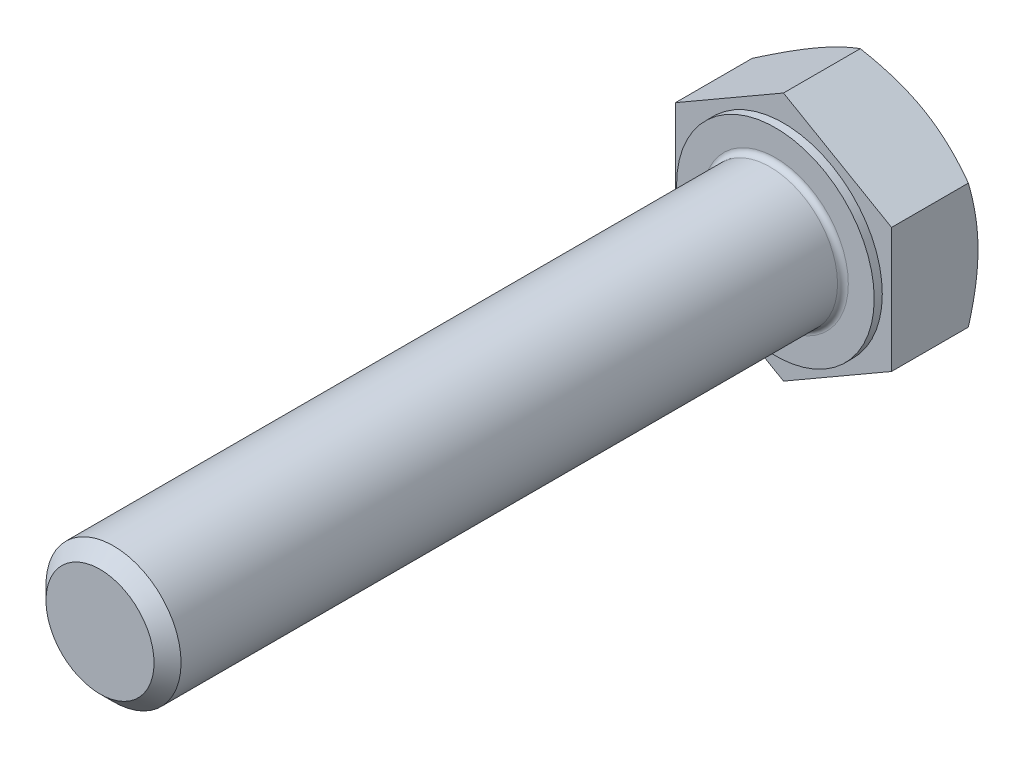
ISO-10303-21;
HEADER;
FILE_DESCRIPTION(('STEP AP214'),'2;1');
FILE_NAME('part.step','',(''),(''),'','','');
FILE_SCHEMA(('AUTOMOTIVE_DESIGN { 1 0 10303 214 1 1 1 1 }'));
ENDSEC;
DATA;
#1=APPLICATION_CONTEXT('core data for automotive mechanical design processes');
#2=APPLICATION_PROTOCOL_DEFINITION('international standard','automotive_design',2000,#1);
#3=PRODUCT_CONTEXT('',#1,'mechanical');
#4=PRODUCT('Part','Part','',(#3));
#5=PRODUCT_RELATED_PRODUCT_CATEGORY('part','',(#4));
#6=PRODUCT_DEFINITION_FORMATION('','',#4);
#7=PRODUCT_DEFINITION_CONTEXT('part definition',#1,'design');
#8=PRODUCT_DEFINITION('design','',#6,#7);
#9=PRODUCT_DEFINITION_SHAPE('','',#8);
#10=(LENGTH_UNIT() NAMED_UNIT(*) SI_UNIT(.MILLI.,.METRE.));
#11=(NAMED_UNIT(*) PLANE_ANGLE_UNIT() SI_UNIT($,.RADIAN.));
#12=(NAMED_UNIT(*) SI_UNIT($,.STERADIAN.) SOLID_ANGLE_UNIT());
#13=UNCERTAINTY_MEASURE_WITH_UNIT(LENGTH_MEASURE(1.E-05),#10,'distance_accuracy_value','');
#14=(GEOMETRIC_REPRESENTATION_CONTEXT(3) GLOBAL_UNCERTAINTY_ASSIGNED_CONTEXT((#13)) GLOBAL_UNIT_ASSIGNED_CONTEXT((#10,
#11,#12)) REPRESENTATION_CONTEXT('',''));
#15=CARTESIAN_POINT('',(0.,0.,0.));
#16=DIRECTION('',(0.,0.,1.));
#17=DIRECTION('',(1.,0.,0.));
#18=AXIS2_PLACEMENT_3D('',#15,#16,#17);
#19=CARTESIAN_POINT('',(0.,0.,7.));
#20=DIRECTION('',(0.,0.,1.));
#21=DIRECTION('',(1.,0.,0.));
#22=AXIS2_PLACEMENT_3D('',#19,#20,#21);
#23=PLANE('',#22);
#24=CARTESIAN_POINT('',(0.,0.,7.));
#25=DIRECTION('',(0.,0.,1.));
#26=DIRECTION('',(1.,0.,0.));
#27=AXIS2_PLACEMENT_3D('',#24,#25,#26);
#28=CIRCLE('',#27,5.4);
#29=CARTESIAN_POINT('',(5.4,0.,7.));
#30=VERTEX_POINT('',#29);
#31=EDGE_CURVE('E11',#30,#30,#28,.F.);
#32=ORIENTED_EDGE('',*,*,#31,.T.);
#33=EDGE_LOOP('',(#32));
#34=FACE_BOUND('',#33,.T.);
#35=CARTESIAN_POINT('',(0.,0.,7.));
#36=DIRECTION('',(0.,0.,1.));
#37=DIRECTION('',(1.,0.,0.));
#38=AXIS2_PLACEMENT_3D('',#35,#36,#37);
#39=CIRCLE('',#38,7.315);
#40=CARTESIAN_POINT('',(7.315,0.,7.));
#41=VERTEX_POINT('',#40);
#42=EDGE_CURVE('E269',#41,#41,#39,.T.);
#43=ORIENTED_EDGE('',*,*,#42,.T.);
#44=EDGE_LOOP('',(#43));
#45=FACE_BOUND('',#44,.T.);
#46=ADVANCED_FACE('F35',(#34,#45),#23,.T.);
#47=CARTESIAN_POINT('',(7.99999999999999,-4.618802153517,6.4));
#48=DIRECTION('',(0.,0.,1.));
#49=DIRECTION('',(1.,0.,0.));
#50=AXIS2_PLACEMENT_3D('',#47,#48,#49);
#51=PLANE('',#50);
#52=DIRECTION('',(0.866025403784439,0.5,0.));
#53=VECTOR('',#52,1.);
#54=CARTESIAN_POINT('',(0.,-9.23760430703401,6.4));
#55=LINE('',#54,#53);
#56=CARTESIAN_POINT('',(0.,-9.23760430703401,6.4));
#57=VERTEX_POINT('',#56);
#58=CARTESIAN_POINT('',(7.99999999999999,-4.61880215351701,6.4));
#59=VERTEX_POINT('',#58);
#60=EDGE_CURVE('E289',#57,#59,#55,.T.);
#61=ORIENTED_EDGE('',*,*,#60,.T.);
#62=DIRECTION('',(0.,1.,0.));
#63=VECTOR('',#62,1.);
#64=CARTESIAN_POINT('',(7.99999999999999,-4.61880215351701,6.4));
#65=LINE('',#64,#63);
#66=CARTESIAN_POINT('',(7.99999999999999,4.61880215351704,6.4));
#67=VERTEX_POINT('',#66);
#68=EDGE_CURVE('E294',#59,#67,#65,.T.);
#69=ORIENTED_EDGE('',*,*,#68,.T.);
#70=DIRECTION('',(-0.866025403784439,0.5,0.));
#71=VECTOR('',#70,1.);
#72=CARTESIAN_POINT('',(7.99999999999999,4.61880215351704,6.4));
#73=LINE('',#72,#71);
#74=CARTESIAN_POINT('',(0.,9.23760430703404,6.4));
#75=VERTEX_POINT('',#74);
#76=EDGE_CURVE('E291',#67,#75,#73,.T.);
#77=ORIENTED_EDGE('',*,*,#76,.T.);
#78=DIRECTION('',(-0.866025403784438,-0.500000000000001,0.));
#79=VECTOR('',#78,1.);
#80=CARTESIAN_POINT('',(0.,9.23760430703404,6.4));
#81=LINE('',#80,#79);
#82=CARTESIAN_POINT('',(-8.00000000000001,4.61880215351702,6.4));
#83=VERTEX_POINT('',#82);
#84=EDGE_CURVE('E290',#75,#83,#81,.T.);
#85=ORIENTED_EDGE('',*,*,#84,.T.);
#86=DIRECTION('',(0.,-1.,0.));
#87=VECTOR('',#86,1.);
#88=CARTESIAN_POINT('',(-8.00000000000001,4.61880215351702,6.4));
#89=LINE('',#88,#87);
#90=CARTESIAN_POINT('',(-8.00000000000001,-4.618802153517,6.4));
#91=VERTEX_POINT('',#90);
#92=EDGE_CURVE('E213',#83,#91,#89,.T.);
#93=ORIENTED_EDGE('',*,*,#92,.T.);
#94=DIRECTION('',(0.866025403784438,-0.5,0.));
#95=VECTOR('',#94,1.);
#96=CARTESIAN_POINT('',(-8.00000000000001,-4.618802153517,6.4));
#97=LINE('',#96,#95);
#98=EDGE_CURVE('E284',#91,#57,#97,.T.);
#99=ORIENTED_EDGE('',*,*,#98,.T.);
#100=EDGE_LOOP('',(#61,#69,#77,#85,#93,#99));
#101=FACE_BOUND('',#100,.T.);
#102=CARTESIAN_POINT('',(0.,0.,6.4));
#103=DIRECTION('',(0.,0.,1.));
#104=DIRECTION('',(1.,0.,0.));
#105=AXIS2_PLACEMENT_3D('',#102,#103,#104);
#106=CIRCLE('',#105,7.315);
#107=CARTESIAN_POINT('',(7.315,0.,6.4));
#108=VERTEX_POINT('',#107);
#109=EDGE_CURVE('E272',#108,#108,#106,.T.);
#110=ORIENTED_EDGE('',*,*,#109,.F.);
#111=EDGE_LOOP('',(#110));
#112=FACE_BOUND('',#111,.T.);
#113=ADVANCED_FACE('F249',(#101,#112),#51,.T.);
#114=CARTESIAN_POINT('',(0.,-9.23760430703401,6.4));
#115=DIRECTION('',(-0.5,0.866025403784439,0.));
#116=DIRECTION('',(-0.866025403784439,-0.5,0.));
#117=AXIS2_PLACEMENT_3D('',#114,#115,#116);
#118=PLANE('',#117);
#119=CARTESIAN_POINT('',(8.00019999999999,-4.61868668346317,0.714597847732973));
#120=CARTESIAN_POINT('',(7.8243512161201,-4.72021302617289,0.655990714047299));
#121=CARTESIAN_POINT('',(7.64784680569386,-4.82211789504564,0.600043401047292));
#122=CARTESIAN_POINT('',(7.29340453712153,-5.02675523421805,0.49420100502467));
#123=CARTESIAN_POINT('',(7.11546609530728,-5.12948804149869,0.44430853443107));
#124=CARTESIAN_POINT('',(6.57880176237735,-5.43933133858026,0.304692797206872));
#125=CARTESIAN_POINT('',(6.21795741776427,-5.64766491807818,0.225281170978375));
#126=CARTESIAN_POINT('',(5.67796082979594,-5.95943209350317,0.132161646294497));
#127=CARTESIAN_POINT('',(5.50042181035671,-6.06193429416807,0.105634581029133));
#128=CARTESIAN_POINT('',(5.1445408870398,-6.26740224104455,0.0611531748588848));
#129=CARTESIAN_POINT('',(4.96619905550676,-6.37036794548792,0.0431980765145895));
#130=CARTESIAN_POINT('',(4.6092083151764,-6.57647664551585,0.0163156484918753));
#131=CARTESIAN_POINT('',(4.43055998639049,-6.67961930623067,0.00737807354624393));
#132=CARTESIAN_POINT('',(4.07309829490261,-6.88599991003618,-0.00127769603485897));
#133=CARTESIAN_POINT('',(3.89428493746993,-6.98923785008464,-0.000996175497139125));
#134=CARTESIAN_POINT('',(3.55998663298309,-7.18224506616975,0.00814502526878669));
#135=CARTESIAN_POINT('',(3.40447809566132,-7.27202796205376,0.0158896043673809));
#136=CARTESIAN_POINT('',(3.09382523825948,-7.45138347289924,0.0382011348534398));
#137=CARTESIAN_POINT('',(2.93868094344,-7.5409560732765,0.0527685461381592));
#138=CARTESIAN_POINT('',(2.47384868410518,-7.80932710333148,0.106360690527548));
#139=CARTESIAN_POINT('',(2.16498351281827,-7.98765049311728,0.155268641669156));
#140=CARTESIAN_POINT('',(1.54397677123969,-8.34618890253624,0.277539403234326));
#141=CARTESIAN_POINT('',(1.23191445788551,-8.52635816315521,0.351420520376011));
#142=CARTESIAN_POINT('',(0.612443518305232,-8.88400987687704,0.519100141254984));
#143=CARTESIAN_POINT('',(0.30502695910824,-9.06149691008277,0.612859260854467));
#144=CARTESIAN_POINT('',(-0.000200000000009269,-9.23771977708785,0.714597847732988));
#145=B_SPLINE_CURVE_WITH_KNOTS('',3,(#119,#120,#121,#122,#123,#124,#125,#126,#127,#128,#129,
#130,#131,#132,#133,#134,#135,#136,#137,#138,#139,#140,#141,#142,#143,#144),.UNSPECIFIED.,.F.,
.F.,(4,2,2,2,2,2,2,2,2,2,2,2,4),(0.,0.633973543721349,1.26821965714356,2.53934712434765,
3.15934343977049,3.77928496069783,4.39852133866765,5.01773858515595,5.55680239410248,
6.09590254421147,7.17487077411834,8.27776850154293,9.37850115249054),.UNSPECIFIED.);
#146=CARTESIAN_POINT('',(7.99999999999999,-4.61880215351701,0.714531179816321));
#147=VERTEX_POINT('',#146);
#148=CARTESIAN_POINT('',(4.00000000000001,-6.92820323027549,0.));
#149=VERTEX_POINT('',#148);
#150=EDGE_CURVE('E128',#147,#149,#145,.T.);
#151=ORIENTED_EDGE('',*,*,#150,.F.);
#152=DIRECTION('',(0.,0.,-1.));
#153=VECTOR('',#152,1.);
#154=CARTESIAN_POINT('',(7.99999999999999,-4.61880215351701,6.4));
#155=LINE('',#154,#153);
#156=EDGE_CURVE('E132',#59,#147,#155,.T.);
#157=ORIENTED_EDGE('',*,*,#156,.F.);
#158=ORIENTED_EDGE('',*,*,#60,.F.);
#159=DIRECTION('',(0.,0.,-1.));
#160=VECTOR('',#159,1.);
#161=CARTESIAN_POINT('',(0.,-9.23760430703401,6.4));
#162=LINE('',#161,#160);
#163=CARTESIAN_POINT('',(0.,-9.23760430703401,0.714531179816338));
#164=VERTEX_POINT('',#163);
#165=EDGE_CURVE('E220',#57,#164,#162,.T.);
#166=ORIENTED_EDGE('',*,*,#165,.T.);
#167=EDGE_CURVE('E187',#149,#164,#145,.T.);
#168=ORIENTED_EDGE('',*,*,#167,.F.);
#169=EDGE_LOOP('',(#151,#157,#158,#166,#168));
#170=FACE_BOUND('',#169,.T.);
#171=ADVANCED_FACE('F37',(#170),#118,.F.);
#172=CARTESIAN_POINT('',(7.99999999999999,-4.61880215351701,6.4));
#173=DIRECTION('',(-1.,0.,0.));
#174=DIRECTION('',(0.,-1.,0.));
#175=AXIS2_PLACEMENT_3D('',#172,#173,#174);
#176=PLANE('',#175);
#177=CARTESIAN_POINT('',(8.,-12.5978512379924,3.99718793883615));
#178=CARTESIAN_POINT('',(8.,-12.2467462008623,3.82611053940334));
#179=CARTESIAN_POINT('',(8.,-11.8948553433713,3.6566192611714));
#180=CARTESIAN_POINT('',(8.,-11.1890846954052,3.32169749206442));
#181=CARTESIAN_POINT('',(8.,-10.8352046182408,3.15626760597495));
#182=CARTESIAN_POINT('',(8.,-10.1233054922673,2.82956556630699));
#183=CARTESIAN_POINT('',(8.,-9.7652745025072,2.66831934580666));
#184=CARTESIAN_POINT('',(8.,-9.0464305509782,2.35217634936252));
#185=CARTESIAN_POINT('',(8.,-8.68561771623813,2.19727928551022));
#186=CARTESIAN_POINT('',(8.,-7.9483682383301,1.89039831332186));
#187=CARTESIAN_POINT('',(7.99999999999999,-7.5718160926994,1.73869040238556));
#188=CARTESIAN_POINT('',(7.99999999999999,-6.81437869925937,1.44630030371825));
#189=CARTESIAN_POINT('',(7.99999999999999,-6.4334929812005,1.30561932587692));
#190=CARTESIAN_POINT('',(7.99999999999999,-5.66743060053096,1.03883650548179));
#191=CARTESIAN_POINT('',(7.99999999999999,-5.28226376097155,0.912706750602057));
#192=CARTESIAN_POINT('',(7.99999999999999,-4.50642198062752,0.678945126896403));
#193=CARTESIAN_POINT('',(7.99999999999999,-4.11574875435181,0.571307632092994));
#194=CARTESIAN_POINT('',(7.99999999999999,-3.33076858870341,0.380144492843309));
#195=CARTESIAN_POINT('',(7.99999999999999,-2.93649538963686,0.296483961645666));
#196=CARTESIAN_POINT('',(7.99999999999999,-2.34134760665674,0.192507402949676));
#197=CARTESIAN_POINT('',(7.99999999999999,-2.14232907921831,0.161432948292051));
#198=CARTESIAN_POINT('',(7.99999999999999,-1.74323916254378,0.107059745298361));
#199=CARTESIAN_POINT('',(7.99999999999999,-1.54316787755479,0.08376024125338));
#200=CARTESIAN_POINT('',(7.99999999999999,-1.14493807054614,0.0457037662085175));
#201=CARTESIAN_POINT('',(7.99999999999999,-0.946790214610576,0.0308356597820143));
#202=CARTESIAN_POINT('',(7.99999999999999,-0.550042656011035,0.0094999741116222));
#203=CARTESIAN_POINT('',(7.99999999999999,-0.351442961205345,0.00303224987198891));
#204=CARTESIAN_POINT('',(7.99999999999999,0.0458536848218862,-0.00134753653582584));
#205=CARTESIAN_POINT('',(7.99999999999999,0.244550636578432,0.000740448901561758));
#206=CARTESIAN_POINT('',(7.99999999999999,0.641675336162368,0.0134189763252811));
#207=CARTESIAN_POINT('',(7.99999999999999,0.840103071267307,0.0240099070177643));
#208=CARTESIAN_POINT('',(7.99999999999999,1.31123186982788,0.0590218930776829));
#209=CARTESIAN_POINT('',(7.99999999999999,1.58366327873405,0.0871569090600229));
#210=CARTESIAN_POINT('',(7.99999999999999,2.12661565083681,0.157962895158833));
#211=CARTESIAN_POINT('',(7.99999999999999,2.39713637140872,0.200635678615242));
#212=CARTESIAN_POINT('',(7.99999999999999,3.20545284693186,0.348206949403021));
#213=CARTESIAN_POINT('',(7.99999999999999,3.73973647035001,0.472635836816971));
#214=CARTESIAN_POINT('',(7.99999999999999,4.53906437171197,0.689870049452254));
#215=CARTESIAN_POINT('',(7.99999999999999,4.80821183981299,0.768458172110074));
#216=CARTESIAN_POINT('',(7.99999999999999,5.34389593094854,0.934158301510446));
#217=CARTESIAN_POINT('',(7.99999999999998,5.61043253382537,1.02127037400683));
#218=CARTESIAN_POINT('',(7.99999999999998,6.14097487541761,1.20259084637433));
#219=CARTESIAN_POINT('',(7.99999999999998,6.40498130265927,1.2967972501017));
#220=CARTESIAN_POINT('',(7.99999999999998,6.93077993426256,1.49116187747737));
#221=CARTESIAN_POINT('',(7.99999999999998,7.19257218933348,1.59131996439542));
#222=CARTESIAN_POINT('',(7.99999999999998,7.89757235163045,1.86876864907012));
#223=CARTESIAN_POINT('',(7.99999999999998,8.33892090709079,2.05077943789114));
#224=CARTESIAN_POINT('',(7.99999999999998,9.21706508902619,2.42550999252133));
#225=CARTESIAN_POINT('',(7.99999999999998,9.65386020176568,2.61823095148799));
#226=CARTESIAN_POINT('',(7.99999999999998,10.5239434444595,3.01184512550083));
#227=CARTESIAN_POINT('',(7.99999999999998,10.9572301549231,3.21274146781485));
#228=CARTESIAN_POINT('',(7.99999999999998,11.8208356851218,3.62074922422547));
#229=CARTESIAN_POINT('',(7.99999999999998,12.2511546254934,3.82786038384345));
#230=CARTESIAN_POINT('',(7.99999999999998,13.1101061520006,4.24728155964496));
#231=CARTESIAN_POINT('',(7.99999999999998,13.5387348984164,4.45959942278756));
#232=CARTESIAN_POINT('',(7.99999999999998,14.3940561323003,4.8881024264408));
#233=CARTESIAN_POINT('',(7.99999999999998,14.8207486035241,5.10428759932118));
#234=CARTESIAN_POINT('',(7.99999999999998,15.6724483868367,5.53971653526799));
#235=CARTESIAN_POINT('',(7.99999999999998,16.0974560528394,5.75895960690552));
#236=CARTESIAN_POINT('',(7.99999999999998,16.9461557925819,6.19997891573997));
#237=CARTESIAN_POINT('',(7.99999999999998,17.369847861019,6.42175516313026));
#238=CARTESIAN_POINT('',(7.99999999999997,18.5495920005301,7.04296873802942));
#239=CARTESIAN_POINT('',(7.99999999999997,19.3044430750826,7.444686406501));
#240=CARTESIAN_POINT('',(7.99999999999997,20.811612877098,8.25294503288146));
#241=CARTESIAN_POINT('',(7.99999999999997,21.5639314443795,8.65948628878841));
#242=CARTESIAN_POINT('',(7.99999999999997,23.0640825603146,9.47479055466271));
#243=CARTESIAN_POINT('',(7.99999999999997,23.8119216844181,9.88354147367209));
#244=CARTESIAN_POINT('',(7.99999999999997,24.9325210106617,10.4987076003205));
#245=CARTESIAN_POINT('',(7.99999999999997,25.3058462793405,10.7040948417505));
#246=CARTESIAN_POINT('',(7.99999999999997,26.0521604365677,11.115478517745));
#247=CARTESIAN_POINT('',(7.99999999999997,26.4251493255352,11.321474951549));
#248=CARTESIAN_POINT('',(7.99999999999997,26.7979906164721,11.5277382507565));
#249=B_SPLINE_CURVE_WITH_KNOTS('',3,(#177,#178,#179,#180,#181,#182,#183,#184,#185,#186,#187,
#188,#189,#190,#191,#192,#193,#194,#195,#196,#197,#198,#199,#200,#201,#202,#203,#204,#205,#206,
#207,#208,#209,#210,#211,#212,#213,#214,#215,#216,#217,#218,#219,#220,#221,#222,#223,#224,#225,
#226,#227,#228,#229,#230,#231,#232,#233,#234,#235,#236,#237,#238,#239,#240,#241,#242,#243,#244,
#245,#246,#247,#248),.UNSPECIFIED.,.F.,.F.,(4,2,2,2,2,2,2,2,2,2,2,2,2,2,2,2,2,2,2,2,2,2,2,2,2,2,
2,2,2,2,2,2,2,2,2,4),(0.,1.17171303849132,2.34359951231736,3.52154780263821,4.69944261855859,
5.91720060649299,7.13509202194904,8.35060699087143,9.56575150120687,10.773919428604,
11.3780812044956,11.9821842400116,12.5781274900013,13.1740604535085,13.7699967329027,
14.3659602566554,15.1871415135151,16.0084252363345,17.6517912356646,18.4928743811267,
19.3339640152243,20.1748178684784,21.0156524119422,22.447658797797,23.8798250361731,
25.3125443569731,26.7452050919381,28.1801767272684,29.6151603790681,31.0498246605576,
32.4844947171041,35.0497345300555,37.6151336556703,40.1718943167389,41.4501744217888,
42.7284529318219),.UNSPECIFIED.);
#250=CARTESIAN_POINT('',(7.99999999999999,4.61880215351704,0.714531179816329));
#251=VERTEX_POINT('',#250);
#252=CARTESIAN_POINT('',(7.99999999999999,0.,0.));
#253=VERTEX_POINT('',#252);
#254=EDGE_CURVE('E107',#251,#253,#249,.F.);
#255=ORIENTED_EDGE('',*,*,#254,.F.);
#256=DIRECTION('',(0.,0.,-1.));
#257=VECTOR('',#256,1.);
#258=CARTESIAN_POINT('',(7.99999999999999,4.61880215351704,6.4));
#259=LINE('',#258,#257);
#260=EDGE_CURVE('E217',#67,#251,#259,.T.);
#261=ORIENTED_EDGE('',*,*,#260,.F.);
#262=ORIENTED_EDGE('',*,*,#68,.F.);
#263=ORIENTED_EDGE('',*,*,#156,.T.);
#264=EDGE_CURVE('E120',#253,#147,#249,.F.);
#265=ORIENTED_EDGE('',*,*,#264,.F.);
#266=EDGE_LOOP('',(#255,#261,#262,#263,#265));
#267=FACE_BOUND('',#266,.T.);
#268=ADVANCED_FACE('F139',(#267),#176,.F.);
#269=CARTESIAN_POINT('',(7.99999999999999,4.61880215351704,6.4));
#270=DIRECTION('',(-0.5,-0.866025403784439,0.));
#271=DIRECTION('',(0.866025403784439,-0.5,0.));
#272=AXIS2_PLACEMENT_3D('',#269,#270,#271);
#273=PLANE('',#272);
#274=CARTESIAN_POINT('',(-0.000199999999994588,9.23771977708788,0.714597847733005));
#275=CARTESIAN_POINT('',(0.175648783879902,9.13619343437815,0.65599071404733));
#276=CARTESIAN_POINT('',(0.35215319430614,9.03428856550541,0.600043401047322));
#277=CARTESIAN_POINT('',(0.706595462878465,8.829651226333,0.494201005024698));
#278=CARTESIAN_POINT('',(0.884533904692718,8.72691841905235,0.444308534431098));
#279=CARTESIAN_POINT('',(1.42119823762265,8.41707512197079,0.304692797206897));
#280=CARTESIAN_POINT('',(1.78204258223573,8.20874154247287,0.2252811709784));
#281=CARTESIAN_POINT('',(2.32203917020406,7.89697436704787,0.13216164629452));
#282=CARTESIAN_POINT('',(2.49957818964329,7.79447216638297,0.105634581029155));
#283=CARTESIAN_POINT('',(2.85545911296021,7.5890042195065,0.0611531748589059));
#284=CARTESIAN_POINT('',(3.03380094449325,7.48603851506312,0.0431980765146104));
#285=CARTESIAN_POINT('',(3.39079168482361,7.27992981503519,0.016315648491895));
#286=CARTESIAN_POINT('',(3.56944001360951,7.17678715432037,0.00737807354626257));
#287=CARTESIAN_POINT('',(3.9269017050974,6.97040655051486,-0.00127769603484128));
#288=CARTESIAN_POINT('',(4.10571506253008,6.8671686104664,-0.000996175497121333));
#289=CARTESIAN_POINT('',(4.44001336701692,6.67416139438129,0.00814502526880371));
#290=CARTESIAN_POINT('',(4.59552190433868,6.58437849849728,0.0158896043673971));
#291=CARTESIAN_POINT('',(4.90617476174052,6.40502298765181,0.0382011348534544));
#292=CARTESIAN_POINT('',(5.06131905656001,6.31545038727454,0.052768546138173));
#293=CARTESIAN_POINT('',(5.52615131589482,6.04707935721956,0.10636069052756));
#294=CARTESIAN_POINT('',(5.83501648718172,5.86875596743377,0.155268641669166));
#295=CARTESIAN_POINT('',(6.4560232287603,5.51021755801481,0.277539403234332));
#296=CARTESIAN_POINT('',(6.76808554211447,5.33004829739584,0.351420520376014));
#297=CARTESIAN_POINT('',(7.38755648169475,4.97239658367401,0.519100141254981));
#298=CARTESIAN_POINT('',(7.69497304089174,4.79490955046828,0.612859260854462));
#299=CARTESIAN_POINT('',(8.00019999999999,4.61868668346321,0.71459784773298));
#300=B_SPLINE_CURVE_WITH_KNOTS('',3,(#274,#275,#276,#277,#278,#279,#280,#281,#282,#283,#284,
#285,#286,#287,#288,#289,#290,#291,#292,#293,#294,#295,#296,#297,#298,#299),.UNSPECIFIED.,.F.,
.F.,(4,2,2,2,2,2,2,2,2,2,2,2,4),(0.,0.633973543721351,1.26821965714356,2.53934712434766,
3.1593434397705,3.77928496069784,4.39852133866767,5.01773858515596,5.55680239410249,
6.09590254421148,7.17487077411834,8.27776850154291,9.37850115249052),.UNSPECIFIED.);
#301=CARTESIAN_POINT('',(0.,9.23760430703404,0.714531179816354));
#302=VERTEX_POINT('',#301);
#303=CARTESIAN_POINT('',(4.00000000000001,6.92820323027549,0.));
#304=VERTEX_POINT('',#303);
#305=EDGE_CURVE('E51',#302,#304,#300,.T.);
#306=ORIENTED_EDGE('',*,*,#305,.F.);
#307=DIRECTION('',(0.,0.,-1.));
#308=VECTOR('',#307,1.);
#309=CARTESIAN_POINT('',(0.,9.23760430703404,6.4));
#310=LINE('',#309,#308);
#311=EDGE_CURVE('E214',#75,#302,#310,.T.);
#312=ORIENTED_EDGE('',*,*,#311,.F.);
#313=ORIENTED_EDGE('',*,*,#76,.F.);
#314=ORIENTED_EDGE('',*,*,#260,.T.);
#315=EDGE_CURVE('E114',#304,#251,#300,.T.);
#316=ORIENTED_EDGE('',*,*,#315,.F.);
#317=EDGE_LOOP('',(#306,#312,#313,#314,#316));
#318=FACE_BOUND('',#317,.T.);
#319=ADVANCED_FACE('F164',(#318),#273,.F.);
#320=CARTESIAN_POINT('',(0.,9.23760430703404,6.4));
#321=DIRECTION('',(0.500000000000001,-0.866025403784438,0.));
#322=DIRECTION('',(0.866025403784438,0.500000000000001,0.));
#323=AXIS2_PLACEMENT_3D('',#320,#321,#322);
#324=PLANE('',#323);
#325=CARTESIAN_POINT('',(-8.00020000000001,4.61868668346318,0.714597847733008));
#326=CARTESIAN_POINT('',(-7.82435121612011,4.72021302617291,0.655990714047332));
#327=CARTESIAN_POINT('',(-7.64784680569387,4.82211789504565,0.600043401047325));
#328=CARTESIAN_POINT('',(-7.29340453712155,5.02675523421807,0.494201005024701));
#329=CARTESIAN_POINT('',(-7.1154660953073,5.12948804149871,0.444308534431101));
#330=CARTESIAN_POINT('',(-6.57880176237736,5.43933133858027,0.304692797206901));
#331=CARTESIAN_POINT('',(-6.21795741776428,5.64766491807819,0.225281170978403));
#332=CARTESIAN_POINT('',(-5.67796082979596,5.95943209350318,0.132161646294523));
#333=CARTESIAN_POINT('',(-5.50042181035672,6.06193429416809,0.105634581029158));
#334=CARTESIAN_POINT('',(-5.14454088703981,6.26740224104456,0.0611531748589103));
#335=CARTESIAN_POINT('',(-4.96619905550677,6.37036794548793,0.043198076514615));
#336=CARTESIAN_POINT('',(-4.60920831517641,6.57647664551587,0.0163156484919001));
#337=CARTESIAN_POINT('',(-4.43055998639051,6.67961930623069,0.00737807354626786));
#338=CARTESIAN_POINT('',(-4.07309829490262,6.8859999100362,-0.00127769603483584));
#339=CARTESIAN_POINT('',(-3.89428493746994,6.98923785008466,-0.000996175497115927));
#340=CARTESIAN_POINT('',(-3.5599866329831,7.18224506616977,0.00814502526881001));
#341=CARTESIAN_POINT('',(-3.40447809566133,7.27202796205378,0.0158896043674043));
#342=CARTESIAN_POINT('',(-3.09382523825949,7.45138347289926,0.038201134853462));
#343=CARTESIAN_POINT('',(-2.93868094344001,7.54095607327652,0.0527685461381801));
#344=CARTESIAN_POINT('',(-2.47384868410519,7.8093271033315,0.106360690527567));
#345=CARTESIAN_POINT('',(-2.16498351281828,7.9876504931173,0.155268641669176));
#346=CARTESIAN_POINT('',(-1.5439767712397,8.34618890253627,0.277539403234346));
#347=CARTESIAN_POINT('',(-1.23191445788552,8.52635816315524,0.35142052037603));
#348=CARTESIAN_POINT('',(-0.612443518305238,8.88400987687707,0.519100141255));
#349=CARTESIAN_POINT('',(-0.305026959108245,9.0614969100828,0.612859260854483));
#350=CARTESIAN_POINT('',(0.00020000000000519,9.23771977708788,0.714597847733004));
#351=B_SPLINE_CURVE_WITH_KNOTS('',3,(#325,#326,#327,#328,#329,#330,#331,#332,#333,#334,#335,
#336,#337,#338,#339,#340,#341,#342,#343,#344,#345,#346,#347,#348,#349,#350),.UNSPECIFIED.,.F.,
.F.,(4,2,2,2,2,2,2,2,2,2,2,2,4),(0.,0.633973543721351,1.26821965714356,2.53934712434766,
3.15934343977049,3.77928496069784,4.39852133866766,5.01773858515595,5.55680239410249,
6.09590254421148,7.17487077411836,8.27776850154294,9.37850115249056),.UNSPECIFIED.);
#352=CARTESIAN_POINT('',(-8.00000000000001,4.61880215351702,0.714531179816357));
#353=VERTEX_POINT('',#352);
#354=CARTESIAN_POINT('',(-3.99999999999999,6.92820323027551,0.));
#355=VERTEX_POINT('',#354);
#356=EDGE_CURVE('E59',#353,#355,#351,.T.);
#357=ORIENTED_EDGE('',*,*,#356,.F.);
#358=DIRECTION('',(0.,0.,-1.));
#359=VECTOR('',#358,1.);
#360=CARTESIAN_POINT('',(-8.00000000000001,4.61880215351702,6.4));
#361=LINE('',#360,#359);
#362=EDGE_CURVE('E209',#83,#353,#361,.T.);
#363=ORIENTED_EDGE('',*,*,#362,.F.);
#364=ORIENTED_EDGE('',*,*,#84,.F.);
#365=ORIENTED_EDGE('',*,*,#311,.T.);
#366=EDGE_CURVE('E119',#355,#302,#351,.T.);
#367=ORIENTED_EDGE('',*,*,#366,.F.);
#368=EDGE_LOOP('',(#357,#363,#364,#365,#367));
#369=FACE_BOUND('',#368,.T.);
#370=ADVANCED_FACE('F167',(#369),#324,.F.);
#371=CARTESIAN_POINT('',(-8.00000000000001,4.61880215351702,6.4));
#372=DIRECTION('',(1.,0.,0.));
#373=DIRECTION('',(0.,0.,-1.));
#374=AXIS2_PLACEMENT_3D('',#371,#372,#373);
#375=PLANE('',#374);
#376=CARTESIAN_POINT('',(-8.00000000000001,-12.5978512302027,3.99718793503963));
#377=CARTESIAN_POINT('',(-8.00000000000001,-12.246746193335,3.82611053576501));
#378=CARTESIAN_POINT('',(-8.00000000000001,-11.8948553361064,3.65661925769117));
#379=CARTESIAN_POINT('',(-8.00000000000001,-11.1890846886661,3.32169748889962));
#380=CARTESIAN_POINT('',(-8.00000000000001,-10.8352046117649,3.15626760296749));
#381=CARTESIAN_POINT('',(-8.00000000000001,-10.1233054863219,2.82956556361427));
#382=CARTESIAN_POINT('',(-8.00000000000001,-9.76527449682903,2.66831934327132));
#383=CARTESIAN_POINT('',(-8.00000000000001,-9.04643054583629,2.35217634713937));
#384=CARTESIAN_POINT('',(-8.00000000000001,-8.68561771136526,2.19727928344186));
#385=CARTESIAN_POINT('',(-8.00000000000001,-7.94836823401662,1.89039831156784));
#386=CARTESIAN_POINT('',(-8.00000000000001,-7.57181608867648,1.73869040079072));
#387=CARTESIAN_POINT('',(-8.00000000000001,-6.81437869582217,1.44630030243338));
#388=CARTESIAN_POINT('',(-8.00000000000001,-6.43349297805849,1.30561932474281));
#389=CARTESIAN_POINT('',(-8.00000000000001,-5.66743059798478,1.03883650463496));
#390=CARTESIAN_POINT('',(-8.00000000000001,-5.28226375872599,0.912706749891763));
#391=CARTESIAN_POINT('',(-8.00000000000001,-4.5064219789913,0.678945126437168));
#392=CARTESIAN_POINT('',(-8.00000000000001,-4.11574875302431,0.571307631748287));
#393=CARTESIAN_POINT('',(-8.00000000000001,-3.33076858815039,0.380144492729946));
#394=CARTESIAN_POINT('',(-8.00000000000001,-2.93649538955177,0.296483961640452));
#395=CARTESIAN_POINT('',(-8.00000000000001,-2.34134760728193,0.192507403054118));
#396=CARTESIAN_POINT('',(-8.00000000000001,-2.14232908008158,0.161432948424275));
#397=CARTESIAN_POINT('',(-8.00000000000001,-1.74323916388527,0.107059745466595));
#398=CARTESIAN_POINT('',(-8.00000000000001,-1.54316787913642,0.0837602414298471));
#399=CARTESIAN_POINT('',(-8.00000000000001,-1.14493807260307,0.0457037663801717));
#400=CARTESIAN_POINT('',(-8.00000000000001,-0.946790216902643,0.0308356599410161));
#401=CARTESIAN_POINT('',(-8.00000000000001,-0.550042658772982,0.00949997422447585));
#402=CARTESIAN_POINT('',(-8.00000000000001,-0.351442964202037,0.00303224995134722));
#403=CARTESIAN_POINT('',(-8.00000000000001,0.0458536813574046,-0.00134753654388562));
#404=CARTESIAN_POINT('',(-8.00000000000001,0.244550632880907,0.000740448839575818));
#405=CARTESIAN_POINT('',(-8.00000000000001,0.641675332001756,0.0134189761364198));
#406=CARTESIAN_POINT('',(-8.00000000000001,0.840103066876651,0.0240099067559518));
#407=CARTESIAN_POINT('',(-8.00000000000001,1.31123186508473,0.0590218926365415));
#408=CARTESIAN_POINT('',(-8.00000000000001,1.58366327386945,0.0871569085158707));
#409=CARTESIAN_POINT('',(-8.00000000000001,2.12661564573488,0.157962894403191));
#410=CARTESIAN_POINT('',(-8.00000000000001,2.39713636619091,0.20063567775112));
#411=CARTESIAN_POINT('',(-8.00000000000001,3.20545284137284,0.348206948211246));
#412=CARTESIAN_POINT('',(-8.00000000000001,3.73973646457264,0.47263583540395));
#413=CARTESIAN_POINT('',(-8.00000000000001,4.53906436560802,0.689870047712916));
#414=CARTESIAN_POINT('',(-8.00000000000001,4.8082118335978,0.768458170261217));
#415=CARTESIAN_POINT('',(-8.00000000000001,5.34389592451215,0.934158299445977));
#416=CARTESIAN_POINT('',(-8.00000000000001,5.61043252727902,1.02127037183627));
#417=CARTESIAN_POINT('',(-8.00000000000001,6.14097486865219,1.20259084399546));
#418=CARTESIAN_POINT('',(-8.00000000000001,6.40498129578474,1.29679724762062));
#419=CARTESIAN_POINT('',(-8.00000000000001,6.93077992716978,1.4911618747955));
#420=CARTESIAN_POINT('',(-8.00000000000001,7.19257218213157,1.59131996161497));
#421=CARTESIAN_POINT('',(-8.00000000000001,7.8975723443672,1.86876864611981));
#422=CARTESIAN_POINT('',(-8.00000000000001,8.33892089987207,2.05077943488031));
#423=CARTESIAN_POINT('',(-8.00000000000001,9.21706508189078,2.42550998940703));
#424=CARTESIAN_POINT('',(-8.00000000000001,9.65386019466904,2.61823094833077));
#425=CARTESIAN_POINT('',(-8.00000000000001,10.5239434374363,3.01184512227049));
#426=CARTESIAN_POINT('',(-8.00000000000001,10.9572301479345,3.21274146455433));
#427=CARTESIAN_POINT('',(-8.00000000000001,11.8208356781987,3.62074922091358));
#428=CARTESIAN_POINT('',(-8.00000000000001,12.2511546186012,3.82786038051036));
#429=CARTESIAN_POINT('',(-8.00000000000001,13.1101061451692,4.24728155627697));
#430=CARTESIAN_POINT('',(-8.00000000000001,13.538734891615,4.45959941940589));
#431=CARTESIAN_POINT('',(-8.00000000000001,14.3940561255566,4.88810242303671));
#432=CARTESIAN_POINT('',(-8.00000000000001,14.8207485968082,5.10428759590835));
#433=CARTESIAN_POINT('',(-8.00000000000001,15.6724483801741,5.53971653184121));
#434=CARTESIAN_POINT('',(-8.00000000000001,16.0974560462025,5.75895960347355));
#435=CARTESIAN_POINT('',(-8.00000000000001,16.946155785995,6.19997891230045));
#436=CARTESIAN_POINT('',(-8.00000000000001,17.3698478544564,6.42175515968838));
#437=CARTESIAN_POINT('',(-8.00000000000001,18.5495919939929,7.04296873456254));
#438=CARTESIAN_POINT('',(-8.00000000000001,19.3044430685456,7.4446864030135));
#439=CARTESIAN_POINT('',(-8.00000000000001,20.8116128705593,8.25294502935692));
#440=CARTESIAN_POINT('',(-8.00000000000001,21.563931437839,8.65948628524744));
#441=CARTESIAN_POINT('',(-8.00000000000001,23.0640825537621,9.47479055108797));
#442=CARTESIAN_POINT('',(-8.00000000000001,23.8119216778553,9.88354147007997));
#443=CARTESIAN_POINT('',(-8.00000000000001,24.9325210040827,10.4987075967037));
#444=CARTESIAN_POINT('',(-8.00000000000001,25.305846272756,10.7040948381257));
#445=CARTESIAN_POINT('',(-8.00000000000001,26.0521604299717,11.1154785141045));
#446=CARTESIAN_POINT('',(-8.00000000000001,26.4251493189334,11.321474947901));
#447=CARTESIAN_POINT('',(-8.00000000000001,26.7979906098644,11.527738247101));
#448=B_SPLINE_CURVE_WITH_KNOTS('',3,(#376,#377,#378,#379,#380,#381,#382,#383,#384,#385,#386,
#387,#388,#389,#390,#391,#392,#393,#394,#395,#396,#397,#398,#399,#400,#401,#402,#403,#404,#405,
#406,#407,#408,#409,#410,#411,#412,#413,#414,#415,#416,#417,#418,#419,#420,#421,#422,#423,#424,
#425,#426,#427,#428,#429,#430,#431,#432,#433,#434,#435,#436,#437,#438,#439,#440,#441,#442,#443,
#444,#445,#446,#447),.UNSPECIFIED.,.F.,.F.,(4,2,2,2,2,2,2,2,2,2,2,2,2,2,2,2,2,2,2,2,2,2,2,2,2,2,
2,2,2,2,2,2,2,2,2,4),(0.,1.17171303757608,2.34359951048674,3.52154779988271,4.69944261487826,
5.91720060182579,7.13509201629463,8.35060698423298,9.56575149358515,10.7739194195452,
11.3780811947188,11.982184229517,12.5781274788067,13.174060441614,13.7699967203081,
14.3659602433605,15.1871414998262,16.0084252222517,17.651791220792,18.4928743658415,
19.3339639995266,20.1748178523692,21.0156523954214,22.4476587813298,23.87982501976,
25.3125443406161,26.7452050756368,28.1801767110294,29.6151603628915,31.0498246444422,
32.48449470105,35.0497345139727,37.6151336395593,40.1718943005759,41.4501744055995,
42.7284529156064),.UNSPECIFIED.);
#449=CARTESIAN_POINT('',(-8.00000000000001,-4.618802153517,0.714531179816352));
#450=VERTEX_POINT('',#449);
#451=CARTESIAN_POINT('',(-8.,0.,0.));
#452=VERTEX_POINT('',#451);
#453=EDGE_CURVE('E182',#450,#452,#448,.T.);
#454=ORIENTED_EDGE('',*,*,#453,.F.);
#455=DIRECTION('',(0.,0.,-1.));
#456=VECTOR('',#455,1.);
#457=CARTESIAN_POINT('',(-8.00000000000001,-4.618802153517,6.4));
#458=LINE('',#457,#456);
#459=EDGE_CURVE('E215',#91,#450,#458,.T.);
#460=ORIENTED_EDGE('',*,*,#459,.F.);
#461=ORIENTED_EDGE('',*,*,#92,.F.);
#462=ORIENTED_EDGE('',*,*,#362,.T.);
#463=EDGE_CURVE('E141',#452,#353,#448,.T.);
#464=ORIENTED_EDGE('',*,*,#463,.F.);
#465=EDGE_LOOP('',(#454,#460,#461,#462,#464));
#466=FACE_BOUND('',#465,.T.);
#467=ADVANCED_FACE('F172',(#466),#375,.F.);
#468=CARTESIAN_POINT('',(-8.00000000000001,-4.618802153517,6.4));
#469=DIRECTION('',(0.5,0.866025403784438,0.));
#470=DIRECTION('',(-0.866025403784438,0.5,0.));
#471=AXIS2_PLACEMENT_3D('',#468,#469,#470);
#472=PLANE('',#471);
#473=CARTESIAN_POINT('',(0.000199999999990219,-9.23771977708785,0.714597847732989));
#474=CARTESIAN_POINT('',(-0.175648783879906,-9.13619343437813,0.655990714047315));
#475=CARTESIAN_POINT('',(-0.352153194306145,-9.03428856550538,0.600043401047308));
#476=CARTESIAN_POINT('',(-0.706595462878469,-8.82965122633297,0.494201005024685));
#477=CARTESIAN_POINT('',(-0.884533904692722,-8.72691841905232,0.444308534431086));
#478=CARTESIAN_POINT('',(-1.42119823762265,-8.41707512197076,0.304692797206886));
#479=CARTESIAN_POINT('',(-1.78204258223573,-8.20874154247284,0.225281170978389));
#480=CARTESIAN_POINT('',(-2.32203917020406,-7.89697436704785,0.132161646294511));
#481=CARTESIAN_POINT('',(-2.49957818964329,-7.79447216638294,0.105634581029147));
#482=CARTESIAN_POINT('',(-2.85545911296021,-7.58900421950647,0.0611531748588995));
#483=CARTESIAN_POINT('',(-3.03380094449325,-7.4860385150631,0.0431980765146044));
#484=CARTESIAN_POINT('',(-3.3907916848236,-7.27992981503517,0.0163156484918902));
#485=CARTESIAN_POINT('',(-3.56944001360951,-7.17678715432034,0.00737807354625843));
#486=CARTESIAN_POINT('',(-3.92690170509739,-6.97040655051484,-0.00127769603484473));
#487=CARTESIAN_POINT('',(-4.10571506253007,-6.86716861046638,-0.00099617549712476));
#488=CARTESIAN_POINT('',(-4.44001336701691,-6.67416139438127,0.00814502526880153));
#489=CARTESIAN_POINT('',(-4.59552190433868,-6.58437849849726,0.015889604367396));
#490=CARTESIAN_POINT('',(-4.90617476174052,-6.40502298765178,0.038201134853455));
#491=CARTESIAN_POINT('',(-5.06131905656001,-6.31545038727451,0.0527685461381741));
#492=CARTESIAN_POINT('',(-5.52615131589482,-6.04707935721953,0.106360690527563));
#493=CARTESIAN_POINT('',(-5.83501648718173,-5.86875596743374,0.15526864166917));
#494=CARTESIAN_POINT('',(-6.45602322876031,-5.51021755801477,0.27753940323434));
#495=CARTESIAN_POINT('',(-6.76808554211448,-5.3300482973958,0.351420520376026));
#496=CARTESIAN_POINT('',(-7.38755648169477,-4.97239658367398,0.519100141254998));
#497=CARTESIAN_POINT('',(-7.69497304089176,-4.79490955046824,0.612859260854482));
#498=CARTESIAN_POINT('',(-8.00020000000001,-4.61868668346316,0.714597847733003));
#499=B_SPLINE_CURVE_WITH_KNOTS('',3,(#473,#474,#475,#476,#477,#478,#479,#480,#481,#482,#483,
#484,#485,#486,#487,#488,#489,#490,#491,#492,#493,#494,#495,#496,#497,#498),.UNSPECIFIED.,.F.,
.F.,(4,2,2,2,2,2,2,2,2,2,2,2,4),(0.,0.63397354372135,1.26821965714356,2.53934712434765,
3.15934343977049,3.77928496069783,4.39852133866765,5.01773858515595,5.55680239410248,
6.09590254421147,7.17487077411834,8.27776850154292,9.37850115249054),.UNSPECIFIED.);
#500=CARTESIAN_POINT('',(-3.99999999999999,-6.92820323027552,0.));
#501=VERTEX_POINT('',#500);
#502=EDGE_CURVE('E188',#164,#501,#499,.T.);
#503=ORIENTED_EDGE('',*,*,#502,.F.);
#504=ORIENTED_EDGE('',*,*,#165,.F.);
#505=ORIENTED_EDGE('',*,*,#98,.F.);
#506=ORIENTED_EDGE('',*,*,#459,.T.);
#507=EDGE_CURVE('E189',#501,#450,#499,.T.);
#508=ORIENTED_EDGE('',*,*,#507,.F.);
#509=EDGE_LOOP('',(#503,#504,#505,#506,#508));
#510=FACE_BOUND('',#509,.T.);
#511=ADVANCED_FACE('F177',(#510),#472,.F.);
#512=CARTESIAN_POINT('',(0.,0.,0.));
#513=DIRECTION('',(0.,0.,1.));
#514=DIRECTION('',(1.,0.,0.));
#515=AXIS2_PLACEMENT_3D('',#512,#513,#514);
#516=CONICAL_SURFACE('',#515,7.99999999999999,1.0471975511966);
#517=ORIENTED_EDGE('',*,*,#264,.T.);
#518=ORIENTED_EDGE('',*,*,#150,.T.);
#519=CARTESIAN_POINT('',(0.,0.,0.));
#520=DIRECTION('',(0.,0.,1.));
#521=DIRECTION('',(1.,0.,0.));
#522=AXIS2_PLACEMENT_3D('',#519,#520,#521);
#523=CIRCLE('',#522,7.99999999999997);
#524=EDGE_CURVE('E125',#149,#253,#523,.T.);
#525=ORIENTED_EDGE('',*,*,#524,.T.);
#526=EDGE_LOOP('',(#517,#518,#525));
#527=FACE_BOUND('',#526,.T.);
#528=ADVANCED_FACE('F126',(#527),#516,.T.);
#529=ORIENTED_EDGE('',*,*,#167,.T.);
#530=ORIENTED_EDGE('',*,*,#502,.T.);
#531=EDGE_CURVE('E131',#501,#149,#523,.T.);
#532=ORIENTED_EDGE('',*,*,#531,.T.);
#533=EDGE_LOOP('',(#529,#530,#532));
#534=FACE_BOUND('',#533,.T.);
#535=ADVANCED_FACE('F279',(#534),#516,.T.);
#536=ORIENTED_EDGE('',*,*,#453,.T.);
#537=EDGE_CURVE('E286',#452,#501,#523,.T.);
#538=ORIENTED_EDGE('',*,*,#537,.T.);
#539=ORIENTED_EDGE('',*,*,#507,.T.);
#540=EDGE_LOOP('',(#536,#538,#539));
#541=FACE_BOUND('',#540,.T.);
#542=ADVANCED_FACE('F285',(#541),#516,.T.);
#543=ORIENTED_EDGE('',*,*,#356,.T.);
#544=CARTESIAN_POINT('',(0.,0.,0.));
#545=DIRECTION('',(0.,0.,-1.));
#546=DIRECTION('',(-1.,0.,0.));
#547=AXIS2_PLACEMENT_3D('',#544,#545,#546);
#548=CIRCLE('',#547,7.99999999999999);
#549=EDGE_CURVE('E202',#452,#355,#548,.T.);
#550=ORIENTED_EDGE('',*,*,#549,.F.);
#551=ORIENTED_EDGE('',*,*,#463,.T.);
#552=EDGE_LOOP('',(#543,#550,#551));
#553=FACE_BOUND('',#552,.T.);
#554=ADVANCED_FACE('F201',(#553),#516,.T.);
#555=ORIENTED_EDGE('',*,*,#305,.T.);
#556=EDGE_CURVE('E136',#304,#355,#523,.T.);
#557=ORIENTED_EDGE('',*,*,#556,.T.);
#558=ORIENTED_EDGE('',*,*,#366,.T.);
#559=EDGE_LOOP('',(#555,#557,#558));
#560=FACE_BOUND('',#559,.T.);
#561=ADVANCED_FACE('F158',(#560),#516,.T.);
#562=ORIENTED_EDGE('',*,*,#315,.T.);
#563=ORIENTED_EDGE('',*,*,#254,.T.);
#564=EDGE_CURVE('E111',#253,#304,#523,.T.);
#565=ORIENTED_EDGE('',*,*,#564,.T.);
#566=EDGE_LOOP('',(#562,#563,#565));
#567=FACE_BOUND('',#566,.T.);
#568=ADVANCED_FACE('F109',(#567),#516,.T.);
#569=CARTESIAN_POINT('',(7.99999999999999,-4.618802153517,0.));
#570=DIRECTION('',(0.,0.,1.));
#571=DIRECTION('',(1.,0.,0.));
#572=AXIS2_PLACEMENT_3D('',#569,#570,#571);
#573=PLANE('',#572);
#574=ORIENTED_EDGE('',*,*,#564,.F.);
#575=ORIENTED_EDGE('',*,*,#524,.F.);
#576=ORIENTED_EDGE('',*,*,#531,.F.);
#577=ORIENTED_EDGE('',*,*,#537,.F.);
#578=ORIENTED_EDGE('',*,*,#549,.T.);
#579=ORIENTED_EDGE('',*,*,#556,.F.);
#580=EDGE_LOOP('',(#574,#575,#576,#577,#578,#579));
#581=FACE_BOUND('',#580,.T.);
#582=ADVANCED_FACE('F134',(#581),#573,.F.);
#583=CARTESIAN_POINT('',(0.,0.,7.));
#584=DIRECTION('',(0.,0.,-1.));
#585=DIRECTION('',(-1.,0.,0.));
#586=AXIS2_PLACEMENT_3D('',#583,#584,#585);
#587=CYLINDRICAL_SURFACE('',#586,7.315);
#588=ORIENTED_EDGE('',*,*,#42,.F.);
#589=EDGE_LOOP('',(#588));
#590=FACE_BOUND('',#589,.T.);
#591=ORIENTED_EDGE('',*,*,#109,.T.);
#592=EDGE_LOOP('',(#591));
#593=FACE_BOUND('',#592,.T.);
#594=ADVANCED_FACE('F259',(#590,#593),#587,.T.);
#595=CARTESIAN_POINT('',(0.,0.,57.));
#596=DIRECTION('',(0.,0.,-1.));
#597=DIRECTION('',(-1.,0.,0.));
#598=AXIS2_PLACEMENT_3D('',#595,#596,#597);
#599=CYLINDRICAL_SURFACE('',#598,5.);
#600=CARTESIAN_POINT('',(0.,0.,7.4));
#601=DIRECTION('',(0.,0.,1.));
#602=DIRECTION('',(1.,0.,0.));
#603=AXIS2_PLACEMENT_3D('',#600,#601,#602);
#604=CIRCLE('',#603,5.);
#605=CARTESIAN_POINT('',(5.,0.,7.4));
#606=VERTEX_POINT('',#605);
#607=EDGE_CURVE('E44',#606,#606,#604,.T.);
#608=ORIENTED_EDGE('',*,*,#607,.T.);
#609=EDGE_LOOP('',(#608));
#610=FACE_BOUND('',#609,.T.);
#611=CARTESIAN_POINT('',(0.,0.,56.));
#612=DIRECTION('',(0.,0.,1.));
#613=DIRECTION('',(1.,0.,0.));
#614=AXIS2_PLACEMENT_3D('',#611,#612,#613);
#615=CIRCLE('',#614,5.);
#616=CARTESIAN_POINT('',(5.,0.,56.));
#617=VERTEX_POINT('',#616);
#618=EDGE_CURVE('E228',#617,#617,#615,.F.);
#619=ORIENTED_EDGE('',*,*,#618,.T.);
#620=EDGE_LOOP('',(#619));
#621=FACE_BOUND('',#620,.T.);
#622=ADVANCED_FACE('F233',(#610,#621),#599,.T.);
#623=CARTESIAN_POINT('',(0.,0.,57.));
#624=DIRECTION('',(0.,0.,1.));
#625=DIRECTION('',(1.,0.,0.));
#626=AXIS2_PLACEMENT_3D('',#623,#624,#625);
#627=PLANE('',#626);
#628=CARTESIAN_POINT('',(0.,0.,57.));
#629=DIRECTION('',(0.,0.,1.));
#630=DIRECTION('',(1.,0.,0.));
#631=AXIS2_PLACEMENT_3D('',#628,#629,#630);
#632=CIRCLE('',#631,4.);
#633=CARTESIAN_POINT('',(4.,0.,57.));
#634=VERTEX_POINT('',#633);
#635=EDGE_CURVE('E137',#634,#634,#632,.T.);
#636=ORIENTED_EDGE('',*,*,#635,.T.);
#637=EDGE_LOOP('',(#636));
#638=FACE_BOUND('',#637,.T.);
#639=ADVANCED_FACE('F244',(#638),#627,.T.);
#640=CARTESIAN_POINT('',(0.,0.,57.));
#641=DIRECTION('',(0.,0.,-1.));
#642=DIRECTION('',(-1.,0.,0.));
#643=AXIS2_PLACEMENT_3D('',#640,#641,#642);
#644=CONICAL_SURFACE('',#643,4.,0.785398163397443);
#645=ORIENTED_EDGE('',*,*,#618,.F.);
#646=EDGE_LOOP('',(#645));
#647=FACE_BOUND('',#646,.T.);
#648=ORIENTED_EDGE('',*,*,#635,.F.);
#649=EDGE_LOOP('',(#648));
#650=FACE_BOUND('',#649,.T.);
#651=ADVANCED_FACE('F238',(#647,#650),#644,.T.);
#652=CARTESIAN_POINT('',(0.,0.,7.4));
#653=DIRECTION('',(0.,0.,1.));
#654=DIRECTION('',(1.,0.,0.));
#655=AXIS2_PLACEMENT_3D('',#652,#653,#654);
#656=TOROIDAL_SURFACE('',#655,5.4,0.4);
#657=ORIENTED_EDGE('',*,*,#31,.F.);
#658=EDGE_LOOP('',(#657));
#659=FACE_BOUND('',#658,.T.);
#660=ORIENTED_EDGE('',*,*,#607,.F.);
#661=EDGE_LOOP('',(#660));
#662=FACE_BOUND('',#661,.T.);
#663=ADVANCED_FACE('F236',(#659,#662),#656,.F.);
#664=CLOSED_SHELL('',(#46,#113,#171,#268,#319,#370,#467,#511,#528,#535,#542,#554,#561,#568,#582,
#594,#622,#639,#651,#663));
#665=MANIFOLD_SOLID_BREP('B2',#664);
#666=ADVANCED_BREP_SHAPE_REPRESENTATION('',(#18,#665),#14);
#667=SHAPE_DEFINITION_REPRESENTATION(#9,#666);
ENDSEC;
END-ISO-10303-21;
